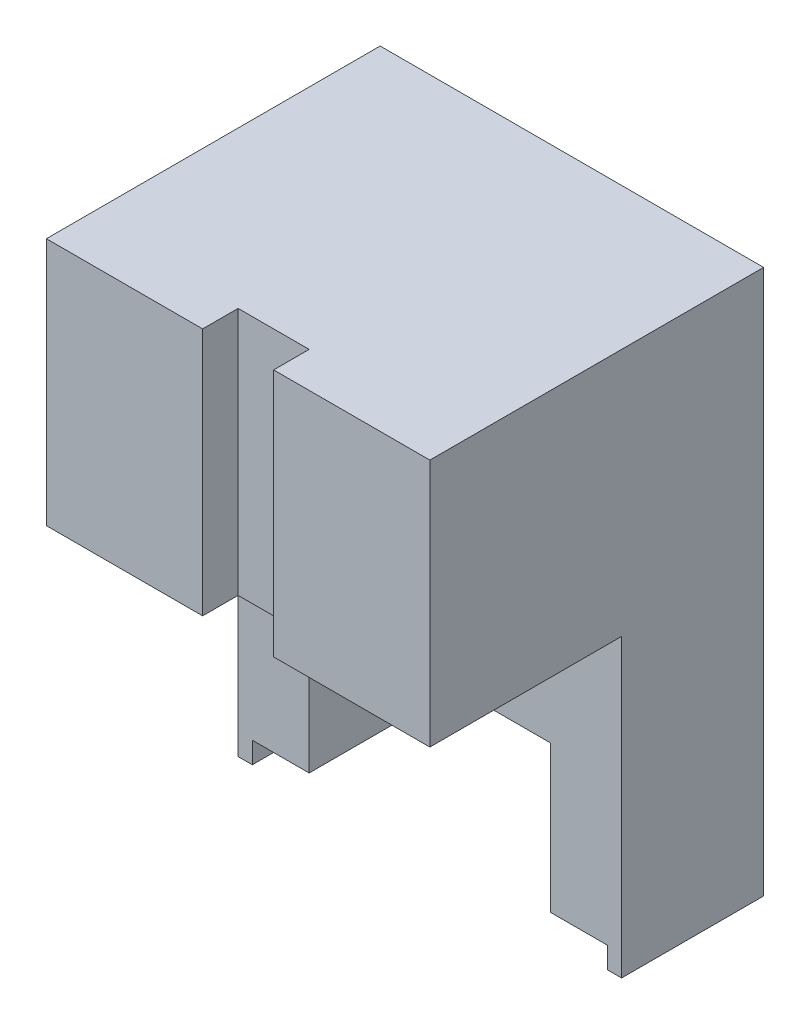
ISO-10303-21;
HEADER;
FILE_DESCRIPTION(('STEP AP214'),'2;1');
FILE_NAME('part.step','',(''),(''),'','','');
FILE_SCHEMA(('AUTOMOTIVE_DESIGN { 1 0 10303 214 1 1 1 1 }'));
ENDSEC;
DATA;
#1=APPLICATION_CONTEXT('core data for automotive mechanical design processes');
#2=APPLICATION_PROTOCOL_DEFINITION('international standard','automotive_design',2000,#1);
#3=PRODUCT_CONTEXT('',#1,'mechanical');
#4=PRODUCT('Part','Part','',(#3));
#5=PRODUCT_RELATED_PRODUCT_CATEGORY('part','',(#4));
#6=PRODUCT_DEFINITION_FORMATION('','',#4);
#7=PRODUCT_DEFINITION_CONTEXT('part definition',#1,'design');
#8=PRODUCT_DEFINITION('design','',#6,#7);
#9=PRODUCT_DEFINITION_SHAPE('','',#8);
#10=(LENGTH_UNIT() NAMED_UNIT(*) SI_UNIT(.MILLI.,.METRE.));
#11=(NAMED_UNIT(*) PLANE_ANGLE_UNIT() SI_UNIT($,.RADIAN.));
#12=(NAMED_UNIT(*) SI_UNIT($,.STERADIAN.) SOLID_ANGLE_UNIT());
#13=UNCERTAINTY_MEASURE_WITH_UNIT(LENGTH_MEASURE(1.E-05),#10,'distance_accuracy_value','');
#14=(GEOMETRIC_REPRESENTATION_CONTEXT(3) GLOBAL_UNCERTAINTY_ASSIGNED_CONTEXT((#13)) GLOBAL_UNIT_ASSIGNED_CONTEXT((#10,
#11,#12)) REPRESENTATION_CONTEXT('',''));
#15=CARTESIAN_POINT('',(0.,0.,0.));
#16=DIRECTION('',(0.,0.,1.));
#17=DIRECTION('',(1.,0.,0.));
#18=AXIS2_PLACEMENT_3D('',#15,#16,#17);
#19=CARTESIAN_POINT('',(-52.,38.66,47.));
#20=DIRECTION('',(0.,0.,1.));
#21=DIRECTION('',(1.,0.,0.));
#22=AXIS2_PLACEMENT_3D('',#19,#20,#21);
#23=PLANE('',#22);
#24=DIRECTION('',(0.,-1.,0.));
#25=VECTOR('',#24,1.);
#26=CARTESIAN_POINT('',(-30.,38.66,47.));
#27=LINE('',#26,#25);
#28=CARTESIAN_POINT('',(-30.,73.66,47.));
#29=VERTEX_POINT('',#28);
#30=CARTESIAN_POINT('',(-30.,38.66,47.));
#31=VERTEX_POINT('',#30);
#32=EDGE_CURVE('E39',#29,#31,#27,.T.);
#33=ORIENTED_EDGE('',*,*,#32,.F.);
#34=DIRECTION('',(-1.,0.,0.));
#35=VECTOR('',#34,1.);
#36=CARTESIAN_POINT('',(-52.,73.66,47.));
#37=LINE('',#36,#35);
#38=CARTESIAN_POINT('',(-52.,73.66,47.));
#39=VERTEX_POINT('',#38);
#40=EDGE_CURVE('E180',#29,#39,#37,.T.);
#41=ORIENTED_EDGE('',*,*,#40,.T.);
#42=DIRECTION('',(0.,-1.,0.));
#43=VECTOR('',#42,1.);
#44=CARTESIAN_POINT('',(-52.,73.66,47.));
#45=LINE('',#44,#43);
#46=CARTESIAN_POINT('',(-52.,38.66,47.));
#47=VERTEX_POINT('',#46);
#48=EDGE_CURVE('E194',#39,#47,#45,.T.);
#49=ORIENTED_EDGE('',*,*,#48,.T.);
#50=DIRECTION('',(1.,0.,0.));
#51=VECTOR('',#50,1.);
#52=CARTESIAN_POINT('',(-52.,38.66,47.));
#53=LINE('',#52,#51);
#54=EDGE_CURVE('E216',#47,#31,#53,.T.);
#55=ORIENTED_EDGE('',*,*,#54,.T.);
#56=EDGE_LOOP('',(#33,#41,#49,#55));
#57=FACE_BOUND('',#56,.T.);
#58=ADVANCED_FACE('F31',(#57),#23,.T.);
#59=CARTESIAN_POINT('',(0.,0.,20.));
#60=DIRECTION('',(1.,0.,0.));
#61=DIRECTION('',(0.,0.,-1.));
#62=AXIS2_PLACEMENT_3D('',#59,#60,#61);
#63=PLANE('',#62);
#64=DIRECTION('',(0.,-1.,0.));
#65=VECTOR('',#64,1.);
#66=CARTESIAN_POINT('',(0.,0.,0.));
#67=LINE('',#66,#65);
#68=CARTESIAN_POINT('',(0.,0.,0.));
#69=VERTEX_POINT('',#68);
#70=CARTESIAN_POINT('',(0.,-3.00000000000001,0.));
#71=VERTEX_POINT('',#70);
#72=EDGE_CURVE('E204',#69,#71,#67,.T.);
#73=ORIENTED_EDGE('',*,*,#72,.T.);
#74=DIRECTION('',(0.,0.,-1.));
#75=VECTOR('',#74,1.);
#76=CARTESIAN_POINT('',(0.,-3.00000000000001,20.));
#77=LINE('',#76,#75);
#78=CARTESIAN_POINT('',(0.,-3.00000000000001,20.));
#79=VERTEX_POINT('',#78);
#80=EDGE_CURVE('E163',#79,#71,#77,.T.);
#81=ORIENTED_EDGE('',*,*,#80,.F.);
#82=DIRECTION('',(0.,-1.,0.));
#83=VECTOR('',#82,1.);
#84=CARTESIAN_POINT('',(0.,0.,20.));
#85=LINE('',#84,#83);
#86=CARTESIAN_POINT('',(0.,0.,20.));
#87=VERTEX_POINT('',#86);
#88=EDGE_CURVE('E190',#87,#79,#85,.T.);
#89=ORIENTED_EDGE('',*,*,#88,.F.);
#90=DIRECTION('',(0.,0.,-1.));
#91=VECTOR('',#90,1.);
#92=CARTESIAN_POINT('',(0.,0.,20.));
#93=LINE('',#92,#91);
#94=EDGE_CURVE('E277',#87,#69,#93,.T.);
#95=ORIENTED_EDGE('',*,*,#94,.T.);
#96=EDGE_LOOP('',(#73,#81,#89,#95));
#97=FACE_BOUND('',#96,.T.);
#98=ADVANCED_FACE('F33',(#97),#63,.F.);
#99=CARTESIAN_POINT('',(0.,-3.00000000000001,20.));
#100=DIRECTION('',(0.,1.,0.));
#101=DIRECTION('',(-1.,0.,0.));
#102=AXIS2_PLACEMENT_3D('',#99,#100,#101);
#103=PLANE('',#102);
#104=DIRECTION('',(1.,0.,0.));
#105=VECTOR('',#104,1.);
#106=CARTESIAN_POINT('',(0.,-3.00000000000001,0.));
#107=LINE('',#106,#105);
#108=CARTESIAN_POINT('',(2.,-3.00000000000001,0.));
#109=VERTEX_POINT('',#108);
#110=EDGE_CURVE('E280',#71,#109,#107,.T.);
#111=ORIENTED_EDGE('',*,*,#110,.T.);
#112=DIRECTION('',(0.,0.,-1.));
#113=VECTOR('',#112,1.);
#114=CARTESIAN_POINT('',(2.,-3.00000000000001,20.));
#115=LINE('',#114,#113);
#116=CARTESIAN_POINT('',(2.,-3.00000000000001,20.));
#117=VERTEX_POINT('',#116);
#118=EDGE_CURVE('E252',#117,#109,#115,.T.);
#119=ORIENTED_EDGE('',*,*,#118,.F.);
#120=DIRECTION('',(1.,0.,0.));
#121=VECTOR('',#120,1.);
#122=CARTESIAN_POINT('',(0.,-3.00000000000001,20.));
#123=LINE('',#122,#121);
#124=EDGE_CURVE('E259',#79,#117,#123,.T.);
#125=ORIENTED_EDGE('',*,*,#124,.F.);
#126=ORIENTED_EDGE('',*,*,#80,.T.);
#127=EDGE_LOOP('',(#111,#119,#125,#126));
#128=FACE_BOUND('',#127,.T.);
#129=ADVANCED_FACE('F365',(#128),#103,.F.);
#130=CARTESIAN_POINT('',(2.,-3.00000000000001,20.));
#131=DIRECTION('',(-1.,0.,0.));
#132=DIRECTION('',(0.,0.,1.));
#133=AXIS2_PLACEMENT_3D('',#130,#131,#132);
#134=PLANE('',#133);
#135=DIRECTION('',(0.,1.,0.));
#136=VECTOR('',#135,1.);
#137=CARTESIAN_POINT('',(2.,-3.00000000000001,0.));
#138=LINE('',#137,#136);
#139=CARTESIAN_POINT('',(2.,73.66,0.));
#140=VERTEX_POINT('',#139);
#141=EDGE_CURVE('E251',#109,#140,#138,.T.);
#142=ORIENTED_EDGE('',*,*,#141,.T.);
#143=DIRECTION('',(0.,0.,-1.));
#144=VECTOR('',#143,1.);
#145=CARTESIAN_POINT('',(2.,73.66,20.));
#146=LINE('',#145,#144);
#147=CARTESIAN_POINT('',(2.,73.66,47.));
#148=VERTEX_POINT('',#147);
#149=EDGE_CURVE('E239',#148,#140,#146,.T.);
#150=ORIENTED_EDGE('',*,*,#149,.F.);
#151=DIRECTION('',(0.,1.,0.));
#152=VECTOR('',#151,1.);
#153=CARTESIAN_POINT('',(2.,38.66,47.));
#154=LINE('',#153,#152);
#155=CARTESIAN_POINT('',(2.,38.66,47.));
#156=VERTEX_POINT('',#155);
#157=EDGE_CURVE('E178',#156,#148,#154,.T.);
#158=ORIENTED_EDGE('',*,*,#157,.F.);
#159=DIRECTION('',(0.,0.,-1.));
#160=VECTOR('',#159,1.);
#161=CARTESIAN_POINT('',(2.,38.66,47.));
#162=LINE('',#161,#160);
#163=CARTESIAN_POINT('',(2.,38.66,20.));
#164=VERTEX_POINT('',#163);
#165=EDGE_CURVE('E179',#156,#164,#162,.T.);
#166=ORIENTED_EDGE('',*,*,#165,.T.);
#167=DIRECTION('',(0.,1.,0.));
#168=VECTOR('',#167,1.);
#169=CARTESIAN_POINT('',(2.,-3.00000000000001,20.));
#170=LINE('',#169,#168);
#171=EDGE_CURVE('E249',#117,#164,#170,.T.);
#172=ORIENTED_EDGE('',*,*,#171,.F.);
#173=ORIENTED_EDGE('',*,*,#118,.T.);
#174=EDGE_LOOP('',(#142,#150,#158,#166,#172,#173));
#175=FACE_BOUND('',#174,.T.);
#176=ADVANCED_FACE('F247',(#175),#134,.F.);
#177=CARTESIAN_POINT('',(2.,73.66,20.));
#178=DIRECTION('',(0.,-1.,0.));
#179=DIRECTION('',(0.,0.,-1.));
#180=AXIS2_PLACEMENT_3D('',#177,#178,#179);
#181=PLANE('',#180);
#182=ORIENTED_EDGE('',*,*,#40,.F.);
#183=DIRECTION('',(0.,0.,1.));
#184=VECTOR('',#183,1.);
#185=CARTESIAN_POINT('',(-30.,73.66,42.));
#186=LINE('',#185,#184);
#187=CARTESIAN_POINT('',(-30.,73.66,42.));
#188=VERTEX_POINT('',#187);
#189=EDGE_CURVE('E211',#188,#29,#186,.T.);
#190=ORIENTED_EDGE('',*,*,#189,.F.);
#191=DIRECTION('',(-1.,0.,0.));
#192=VECTOR('',#191,1.);
#193=CARTESIAN_POINT('',(-30.,73.66,42.));
#194=LINE('',#193,#192);
#195=CARTESIAN_POINT('',(-20.,73.66,42.));
#196=VERTEX_POINT('',#195);
#197=EDGE_CURVE('E173',#196,#188,#194,.T.);
#198=ORIENTED_EDGE('',*,*,#197,.F.);
#199=DIRECTION('',(0.,0.,-1.));
#200=VECTOR('',#199,1.);
#201=CARTESIAN_POINT('',(-20.,73.66,42.));
#202=LINE('',#201,#200);
#203=CARTESIAN_POINT('',(-20.,73.66,47.));
#204=VERTEX_POINT('',#203);
#205=EDGE_CURVE('E158',#204,#196,#202,.T.);
#206=ORIENTED_EDGE('',*,*,#205,.F.);
#207=EDGE_CURVE('E170',#148,#204,#37,.T.);
#208=ORIENTED_EDGE('',*,*,#207,.F.);
#209=ORIENTED_EDGE('',*,*,#149,.T.);
#210=DIRECTION('',(-1.,0.,0.));
#211=VECTOR('',#210,1.);
#212=CARTESIAN_POINT('',(2.,73.66,0.));
#213=LINE('',#212,#211);
#214=CARTESIAN_POINT('',(-52.,73.66,0.));
#215=VERTEX_POINT('',#214);
#216=EDGE_CURVE('E236',#140,#215,#213,.T.);
#217=ORIENTED_EDGE('',*,*,#216,.T.);
#218=DIRECTION('',(0.,0.,-1.));
#219=VECTOR('',#218,1.);
#220=CARTESIAN_POINT('',(-52.,73.66,20.));
#221=LINE('',#220,#219);
#222=EDGE_CURVE('E234',#39,#215,#221,.T.);
#223=ORIENTED_EDGE('',*,*,#222,.F.);
#224=EDGE_LOOP('',(#182,#190,#198,#206,#208,#209,#217,#223));
#225=FACE_BOUND('',#224,.T.);
#226=ADVANCED_FACE('F168',(#225),#181,.F.);
#227=CARTESIAN_POINT('',(-52.,-3.00000000000001,20.));
#228=DIRECTION('',(1.,0.,0.));
#229=DIRECTION('',(0.,0.,-1.));
#230=AXIS2_PLACEMENT_3D('',#227,#228,#229);
#231=PLANE('',#230);
#232=DIRECTION('',(0.,-1.,0.));
#233=VECTOR('',#232,1.);
#234=CARTESIAN_POINT('',(-52.,-3.00000000000001,0.));
#235=LINE('',#234,#233);
#236=CARTESIAN_POINT('',(-52.,-3.00000000000001,0.));
#237=VERTEX_POINT('',#236);
#238=EDGE_CURVE('E284',#215,#237,#235,.T.);
#239=ORIENTED_EDGE('',*,*,#238,.T.);
#240=DIRECTION('',(0.,0.,-1.));
#241=VECTOR('',#240,1.);
#242=CARTESIAN_POINT('',(-52.,-3.00000000000001,20.));
#243=LINE('',#242,#241);
#244=CARTESIAN_POINT('',(-52.,-3.00000000000001,20.));
#245=VERTEX_POINT('',#244);
#246=EDGE_CURVE('E240',#245,#237,#243,.T.);
#247=ORIENTED_EDGE('',*,*,#246,.F.);
#248=DIRECTION('',(0.,-1.,0.));
#249=VECTOR('',#248,1.);
#250=CARTESIAN_POINT('',(-52.,-3.00000000000001,20.));
#251=LINE('',#250,#249);
#252=CARTESIAN_POINT('',(-52.,38.66,20.));
#253=VERTEX_POINT('',#252);
#254=EDGE_CURVE('E196',#253,#245,#251,.T.);
#255=ORIENTED_EDGE('',*,*,#254,.F.);
#256=DIRECTION('',(0.,0.,-1.));
#257=VECTOR('',#256,1.);
#258=CARTESIAN_POINT('',(-52.,38.66,47.));
#259=LINE('',#258,#257);
#260=EDGE_CURVE('E183',#47,#253,#259,.T.);
#261=ORIENTED_EDGE('',*,*,#260,.F.);
#262=ORIENTED_EDGE('',*,*,#48,.F.);
#263=ORIENTED_EDGE('',*,*,#222,.T.);
#264=EDGE_LOOP('',(#239,#247,#255,#261,#262,#263));
#265=FACE_BOUND('',#264,.T.);
#266=ADVANCED_FACE('F242',(#265),#231,.F.);
#267=CARTESIAN_POINT('',(-50.,-3.00000000000001,20.));
#268=DIRECTION('',(0.,1.,0.));
#269=DIRECTION('',(-1.,0.,0.));
#270=AXIS2_PLACEMENT_3D('',#267,#268,#269);
#271=PLANE('',#270);
#272=DIRECTION('',(1.,0.,0.));
#273=VECTOR('',#272,1.);
#274=CARTESIAN_POINT('',(-50.,-3.00000000000001,0.));
#275=LINE('',#274,#273);
#276=CARTESIAN_POINT('',(-50.,-3.00000000000001,0.));
#277=VERTEX_POINT('',#276);
#278=EDGE_CURVE('E286',#237,#277,#275,.T.);
#279=ORIENTED_EDGE('',*,*,#278,.T.);
#280=DIRECTION('',(0.,0.,-1.));
#281=VECTOR('',#280,1.);
#282=CARTESIAN_POINT('',(-50.,-3.00000000000001,20.));
#283=LINE('',#282,#281);
#284=CARTESIAN_POINT('',(-50.,-3.00000000000001,20.));
#285=VERTEX_POINT('',#284);
#286=EDGE_CURVE('E317',#285,#277,#283,.T.);
#287=ORIENTED_EDGE('',*,*,#286,.F.);
#288=DIRECTION('',(1.,0.,0.));
#289=VECTOR('',#288,1.);
#290=CARTESIAN_POINT('',(-50.,-3.00000000000001,20.));
#291=LINE('',#290,#289);
#292=EDGE_CURVE('E263',#245,#285,#291,.T.);
#293=ORIENTED_EDGE('',*,*,#292,.F.);
#294=ORIENTED_EDGE('',*,*,#246,.T.);
#295=EDGE_LOOP('',(#279,#287,#293,#294));
#296=FACE_BOUND('',#295,.T.);
#297=ADVANCED_FACE('F323',(#296),#271,.F.);
#298=CARTESIAN_POINT('',(-50.,0.,20.));
#299=DIRECTION('',(-1.,0.,0.));
#300=DIRECTION('',(0.,0.,1.));
#301=AXIS2_PLACEMENT_3D('',#298,#299,#300);
#302=PLANE('',#301);
#303=DIRECTION('',(0.,1.,0.));
#304=VECTOR('',#303,1.);
#305=CARTESIAN_POINT('',(-50.,0.,0.));
#306=LINE('',#305,#304);
#307=CARTESIAN_POINT('',(-50.,0.,0.));
#308=VERTEX_POINT('',#307);
#309=EDGE_CURVE('E288',#277,#308,#306,.T.);
#310=ORIENTED_EDGE('',*,*,#309,.T.);
#311=DIRECTION('',(0.,0.,-1.));
#312=VECTOR('',#311,1.);
#313=CARTESIAN_POINT('',(-50.,0.,20.));
#314=LINE('',#313,#312);
#315=CARTESIAN_POINT('',(-50.,0.,20.));
#316=VERTEX_POINT('',#315);
#317=EDGE_CURVE('E314',#316,#308,#314,.T.);
#318=ORIENTED_EDGE('',*,*,#317,.F.);
#319=DIRECTION('',(0.,1.,0.));
#320=VECTOR('',#319,1.);
#321=CARTESIAN_POINT('',(-50.,0.,20.));
#322=LINE('',#321,#320);
#323=EDGE_CURVE('E265',#285,#316,#322,.T.);
#324=ORIENTED_EDGE('',*,*,#323,.F.);
#325=ORIENTED_EDGE('',*,*,#286,.T.);
#326=EDGE_LOOP('',(#310,#318,#324,#325));
#327=FACE_BOUND('',#326,.T.);
#328=ADVANCED_FACE('F333',(#327),#302,.F.);
#329=CARTESIAN_POINT('',(-42.,0.,20.));
#330=DIRECTION('',(0.,1.,0.));
#331=DIRECTION('',(-1.,0.,0.));
#332=AXIS2_PLACEMENT_3D('',#329,#330,#331);
#333=PLANE('',#332);
#334=DIRECTION('',(1.,0.,0.));
#335=VECTOR('',#334,1.);
#336=CARTESIAN_POINT('',(-42.,0.,0.));
#337=LINE('',#336,#335);
#338=CARTESIAN_POINT('',(-42.,0.,0.));
#339=VERTEX_POINT('',#338);
#340=EDGE_CURVE('E290',#308,#339,#337,.T.);
#341=ORIENTED_EDGE('',*,*,#340,.T.);
#342=DIRECTION('',(0.,0.,-1.));
#343=VECTOR('',#342,1.);
#344=CARTESIAN_POINT('',(-42.,0.,20.));
#345=LINE('',#344,#343);
#346=CARTESIAN_POINT('',(-42.,0.,20.));
#347=VERTEX_POINT('',#346);
#348=EDGE_CURVE('E311',#347,#339,#345,.T.);
#349=ORIENTED_EDGE('',*,*,#348,.F.);
#350=DIRECTION('',(1.,0.,0.));
#351=VECTOR('',#350,1.);
#352=CARTESIAN_POINT('',(-42.,0.,20.));
#353=LINE('',#352,#351);
#354=EDGE_CURVE('E267',#316,#347,#353,.T.);
#355=ORIENTED_EDGE('',*,*,#354,.F.);
#356=ORIENTED_EDGE('',*,*,#317,.T.);
#357=EDGE_LOOP('',(#341,#349,#355,#356));
#358=FACE_BOUND('',#357,.T.);
#359=ADVANCED_FACE('F337',(#358),#333,.F.);
#360=CARTESIAN_POINT('',(-42.,0.,20.));
#361=DIRECTION('',(-1.,0.,0.));
#362=DIRECTION('',(0.,0.,1.));
#363=AXIS2_PLACEMENT_3D('',#360,#361,#362);
#364=PLANE('',#363);
#365=DIRECTION('',(0.,1.,0.));
#366=VECTOR('',#365,1.);
#367=CARTESIAN_POINT('',(-42.,0.,0.));
#368=LINE('',#367,#366);
#369=CARTESIAN_POINT('',(-42.,20.66,0.));
#370=VERTEX_POINT('',#369);
#371=EDGE_CURVE('E292',#339,#370,#368,.T.);
#372=ORIENTED_EDGE('',*,*,#371,.T.);
#373=DIRECTION('',(0.,0.,-1.));
#374=VECTOR('',#373,1.);
#375=CARTESIAN_POINT('',(-42.,20.66,20.));
#376=LINE('',#375,#374);
#377=CARTESIAN_POINT('',(-42.,20.66,20.));
#378=VERTEX_POINT('',#377);
#379=EDGE_CURVE('E308',#378,#370,#376,.T.);
#380=ORIENTED_EDGE('',*,*,#379,.F.);
#381=DIRECTION('',(0.,1.,0.));
#382=VECTOR('',#381,1.);
#383=CARTESIAN_POINT('',(-42.,0.,20.));
#384=LINE('',#383,#382);
#385=EDGE_CURVE('E269',#347,#378,#384,.T.);
#386=ORIENTED_EDGE('',*,*,#385,.F.);
#387=ORIENTED_EDGE('',*,*,#348,.T.);
#388=EDGE_LOOP('',(#372,#380,#386,#387));
#389=FACE_BOUND('',#388,.T.);
#390=ADVANCED_FACE('F345',(#389),#364,.F.);
#391=CARTESIAN_POINT('',(-8.,20.66,20.));
#392=DIRECTION('',(0.,1.,0.));
#393=DIRECTION('',(0.,0.,1.));
#394=AXIS2_PLACEMENT_3D('',#391,#392,#393);
#395=PLANE('',#394);
#396=DIRECTION('',(1.,0.,0.));
#397=VECTOR('',#396,1.);
#398=CARTESIAN_POINT('',(-8.,20.66,0.));
#399=LINE('',#398,#397);
#400=CARTESIAN_POINT('',(-8.,20.66,0.));
#401=VERTEX_POINT('',#400);
#402=EDGE_CURVE('E294',#370,#401,#399,.T.);
#403=ORIENTED_EDGE('',*,*,#402,.T.);
#404=DIRECTION('',(0.,0.,-1.));
#405=VECTOR('',#404,1.);
#406=CARTESIAN_POINT('',(-8.,20.66,20.));
#407=LINE('',#406,#405);
#408=CARTESIAN_POINT('',(-8.,20.66,20.));
#409=VERTEX_POINT('',#408);
#410=EDGE_CURVE('E305',#409,#401,#407,.T.);
#411=ORIENTED_EDGE('',*,*,#410,.F.);
#412=DIRECTION('',(1.,0.,0.));
#413=VECTOR('',#412,1.);
#414=CARTESIAN_POINT('',(-8.,20.66,20.));
#415=LINE('',#414,#413);
#416=EDGE_CURVE('E271',#378,#409,#415,.T.);
#417=ORIENTED_EDGE('',*,*,#416,.F.);
#418=ORIENTED_EDGE('',*,*,#379,.T.);
#419=EDGE_LOOP('',(#403,#411,#417,#418));
#420=FACE_BOUND('',#419,.T.);
#421=ADVANCED_FACE('F348',(#420),#395,.F.);
#422=CARTESIAN_POINT('',(-8.,0.,20.));
#423=DIRECTION('',(1.,0.,0.));
#424=DIRECTION('',(0.,0.,-1.));
#425=AXIS2_PLACEMENT_3D('',#422,#423,#424);
#426=PLANE('',#425);
#427=DIRECTION('',(0.,-1.,0.));
#428=VECTOR('',#427,1.);
#429=CARTESIAN_POINT('',(-8.,0.,0.));
#430=LINE('',#429,#428);
#431=CARTESIAN_POINT('',(-8.,0.,0.));
#432=VERTEX_POINT('',#431);
#433=EDGE_CURVE('E296',#401,#432,#430,.T.);
#434=ORIENTED_EDGE('',*,*,#433,.T.);
#435=DIRECTION('',(0.,0.,-1.));
#436=VECTOR('',#435,1.);
#437=CARTESIAN_POINT('',(-8.,0.,20.));
#438=LINE('',#437,#436);
#439=CARTESIAN_POINT('',(-8.,0.,20.));
#440=VERTEX_POINT('',#439);
#441=EDGE_CURVE('E302',#440,#432,#438,.T.);
#442=ORIENTED_EDGE('',*,*,#441,.F.);
#443=DIRECTION('',(0.,-1.,0.));
#444=VECTOR('',#443,1.);
#445=CARTESIAN_POINT('',(-8.,0.,20.));
#446=LINE('',#445,#444);
#447=EDGE_CURVE('E273',#409,#440,#446,.T.);
#448=ORIENTED_EDGE('',*,*,#447,.F.);
#449=ORIENTED_EDGE('',*,*,#410,.T.);
#450=EDGE_LOOP('',(#434,#442,#448,#449));
#451=FACE_BOUND('',#450,.T.);
#452=ADVANCED_FACE('F353',(#451),#426,.F.);
#453=CARTESIAN_POINT('',(0.,0.,20.));
#454=DIRECTION('',(0.,1.,0.));
#455=DIRECTION('',(-1.,0.,0.));
#456=AXIS2_PLACEMENT_3D('',#453,#454,#455);
#457=PLANE('',#456);
#458=DIRECTION('',(1.,0.,0.));
#459=VECTOR('',#458,1.);
#460=CARTESIAN_POINT('',(0.,0.,0.));
#461=LINE('',#460,#459);
#462=EDGE_CURVE('E298',#432,#69,#461,.T.);
#463=ORIENTED_EDGE('',*,*,#462,.T.);
#464=ORIENTED_EDGE('',*,*,#94,.F.);
#465=DIRECTION('',(1.,0.,0.));
#466=VECTOR('',#465,1.);
#467=CARTESIAN_POINT('',(0.,0.,20.));
#468=LINE('',#467,#466);
#469=EDGE_CURVE('E275',#440,#87,#468,.T.);
#470=ORIENTED_EDGE('',*,*,#469,.F.);
#471=ORIENTED_EDGE('',*,*,#441,.T.);
#472=EDGE_LOOP('',(#463,#464,#470,#471));
#473=FACE_BOUND('',#472,.T.);
#474=ADVANCED_FACE('F360',(#473),#457,.F.);
#475=CARTESIAN_POINT('',(0.,-3.00000000000001,20.));
#476=DIRECTION('',(0.,0.,1.));
#477=DIRECTION('',(1.,0.,0.));
#478=AXIS2_PLACEMENT_3D('',#475,#476,#477);
#479=PLANE('',#478);
#480=DIRECTION('',(1.,0.,0.));
#481=VECTOR('',#480,1.);
#482=CARTESIAN_POINT('',(-52.,38.66,20.));
#483=LINE('',#482,#481);
#484=EDGE_CURVE('E54',#253,#164,#483,.T.);
#485=ORIENTED_EDGE('',*,*,#484,.F.);
#486=ORIENTED_EDGE('',*,*,#254,.T.);
#487=ORIENTED_EDGE('',*,*,#292,.T.);
#488=ORIENTED_EDGE('',*,*,#323,.T.);
#489=ORIENTED_EDGE('',*,*,#354,.T.);
#490=ORIENTED_EDGE('',*,*,#385,.T.);
#491=ORIENTED_EDGE('',*,*,#416,.T.);
#492=ORIENTED_EDGE('',*,*,#447,.T.);
#493=ORIENTED_EDGE('',*,*,#469,.T.);
#494=ORIENTED_EDGE('',*,*,#88,.T.);
#495=ORIENTED_EDGE('',*,*,#124,.T.);
#496=ORIENTED_EDGE('',*,*,#171,.T.);
#497=EDGE_LOOP('',(#485,#486,#487,#488,#489,#490,#491,#492,#493,#494,#495,#496));
#498=FACE_BOUND('',#497,.T.);
#499=ADVANCED_FACE('F340',(#498),#479,.T.);
#500=CARTESIAN_POINT('',(0.,-3.00000000000001,0.));
#501=DIRECTION('',(0.,0.,1.));
#502=DIRECTION('',(1.,0.,0.));
#503=AXIS2_PLACEMENT_3D('',#500,#501,#502);
#504=PLANE('',#503);
#505=ORIENTED_EDGE('',*,*,#72,.F.);
#506=ORIENTED_EDGE('',*,*,#462,.F.);
#507=ORIENTED_EDGE('',*,*,#433,.F.);
#508=ORIENTED_EDGE('',*,*,#402,.F.);
#509=ORIENTED_EDGE('',*,*,#371,.F.);
#510=ORIENTED_EDGE('',*,*,#340,.F.);
#511=ORIENTED_EDGE('',*,*,#309,.F.);
#512=ORIENTED_EDGE('',*,*,#278,.F.);
#513=ORIENTED_EDGE('',*,*,#238,.F.);
#514=ORIENTED_EDGE('',*,*,#216,.F.);
#515=ORIENTED_EDGE('',*,*,#141,.F.);
#516=ORIENTED_EDGE('',*,*,#110,.F.);
#517=EDGE_LOOP('',(#505,#506,#507,#508,#509,#510,#511,#512,#513,#514,#515,#516));
#518=FACE_BOUND('',#517,.T.);
#519=ADVANCED_FACE('F328',(#518),#504,.F.);
#520=CARTESIAN_POINT('',(-52.,38.66,47.));
#521=DIRECTION('',(0.,1.,0.));
#522=DIRECTION('',(0.,0.,1.));
#523=AXIS2_PLACEMENT_3D('',#520,#521,#522);
#524=PLANE('',#523);
#525=DIRECTION('',(-1.,0.,0.));
#526=VECTOR('',#525,1.);
#527=CARTESIAN_POINT('',(-52.,38.66,42.));
#528=LINE('',#527,#526);
#529=CARTESIAN_POINT('',(-20.,38.66,42.));
#530=VERTEX_POINT('',#529);
#531=CARTESIAN_POINT('',(-30.,38.66,42.));
#532=VERTEX_POINT('',#531);
#533=EDGE_CURVE('E11',#530,#532,#528,.T.);
#534=ORIENTED_EDGE('',*,*,#533,.T.);
#535=DIRECTION('',(0.,0.,1.));
#536=VECTOR('',#535,1.);
#537=CARTESIAN_POINT('',(-30.,38.66,47.));
#538=LINE('',#537,#536);
#539=EDGE_CURVE('E195',#532,#31,#538,.T.);
#540=ORIENTED_EDGE('',*,*,#539,.T.);
#541=ORIENTED_EDGE('',*,*,#54,.F.);
#542=ORIENTED_EDGE('',*,*,#260,.T.);
#543=ORIENTED_EDGE('',*,*,#484,.T.);
#544=ORIENTED_EDGE('',*,*,#165,.F.);
#545=CARTESIAN_POINT('',(-20.,38.66,47.));
#546=VERTEX_POINT('',#545);
#547=EDGE_CURVE('E221',#546,#156,#53,.T.);
#548=ORIENTED_EDGE('',*,*,#547,.F.);
#549=DIRECTION('',(0.,0.,-1.));
#550=VECTOR('',#549,1.);
#551=CARTESIAN_POINT('',(-20.,38.66,47.));
#552=LINE('',#551,#550);
#553=EDGE_CURVE('E46',#546,#530,#552,.T.);
#554=ORIENTED_EDGE('',*,*,#553,.T.);
#555=EDGE_LOOP('',(#534,#540,#541,#542,#543,#544,#548,#554));
#556=FACE_BOUND('',#555,.T.);
#557=ADVANCED_FACE('F215',(#556),#524,.F.);
#558=DIRECTION('',(0.,1.,0.));
#559=VECTOR('',#558,1.);
#560=CARTESIAN_POINT('',(-20.,38.66,47.));
#561=LINE('',#560,#559);
#562=EDGE_CURVE('E155',#546,#204,#561,.T.);
#563=ORIENTED_EDGE('',*,*,#562,.F.);
#564=ORIENTED_EDGE('',*,*,#547,.T.);
#565=ORIENTED_EDGE('',*,*,#157,.T.);
#566=ORIENTED_EDGE('',*,*,#207,.T.);
#567=EDGE_LOOP('',(#563,#564,#565,#566));
#568=FACE_BOUND('',#567,.T.);
#569=ADVANCED_FACE('F176',(#568),#23,.T.);
#570=CARTESIAN_POINT('',(-30.,-3.000025,42.));
#571=DIRECTION('',(0.,0.,-1.));
#572=DIRECTION('',(-1.,0.,0.));
#573=AXIS2_PLACEMENT_3D('',#570,#571,#572);
#574=PLANE('',#573);
#575=DIRECTION('',(0.,1.,0.));
#576=VECTOR('',#575,1.);
#577=CARTESIAN_POINT('',(-20.,-3.000025,42.));
#578=LINE('',#577,#576);
#579=EDGE_CURVE('E226',#530,#196,#578,.T.);
#580=ORIENTED_EDGE('',*,*,#579,.T.);
#581=ORIENTED_EDGE('',*,*,#197,.T.);
#582=DIRECTION('',(0.,1.,0.));
#583=VECTOR('',#582,1.);
#584=CARTESIAN_POINT('',(-30.,-3.000025,42.));
#585=LINE('',#584,#583);
#586=EDGE_CURVE('E225',#532,#188,#585,.T.);
#587=ORIENTED_EDGE('',*,*,#586,.F.);
#588=ORIENTED_EDGE('',*,*,#533,.F.);
#589=EDGE_LOOP('',(#580,#581,#587,#588));
#590=FACE_BOUND('',#589,.T.);
#591=ADVANCED_FACE('F231',(#590),#574,.F.);
#592=CARTESIAN_POINT('',(-30.,-3.000025,42.));
#593=DIRECTION('',(-1.,0.,0.));
#594=DIRECTION('',(0.,0.,1.));
#595=AXIS2_PLACEMENT_3D('',#592,#593,#594);
#596=PLANE('',#595);
#597=ORIENTED_EDGE('',*,*,#586,.T.);
#598=ORIENTED_EDGE('',*,*,#189,.T.);
#599=ORIENTED_EDGE('',*,*,#32,.T.);
#600=ORIENTED_EDGE('',*,*,#539,.F.);
#601=EDGE_LOOP('',(#597,#598,#599,#600));
#602=FACE_BOUND('',#601,.T.);
#603=ADVANCED_FACE('F209',(#602),#596,.F.);
#604=CARTESIAN_POINT('',(-20.,-3.000025,42.));
#605=DIRECTION('',(1.,0.,0.));
#606=DIRECTION('',(0.,0.,-1.));
#607=AXIS2_PLACEMENT_3D('',#604,#605,#606);
#608=PLANE('',#607);
#609=ORIENTED_EDGE('',*,*,#562,.T.);
#610=ORIENTED_EDGE('',*,*,#205,.T.);
#611=ORIENTED_EDGE('',*,*,#579,.F.);
#612=ORIENTED_EDGE('',*,*,#553,.F.);
#613=EDGE_LOOP('',(#609,#610,#611,#612));
#614=FACE_BOUND('',#613,.T.);
#615=ADVANCED_FACE('F157',(#614),#608,.F.);
#616=CLOSED_SHELL('',(#58,#98,#129,#176,#226,#266,#297,#328,#359,#390,#421,#452,#474,#499,#519,
#557,#569,#591,#603,#615));
#617=MANIFOLD_SOLID_BREP('B2',#616);
#618=ADVANCED_BREP_SHAPE_REPRESENTATION('',(#18,#617),#14);
#619=SHAPE_DEFINITION_REPRESENTATION(#9,#618);
ENDSEC;
END-ISO-10303-21;
